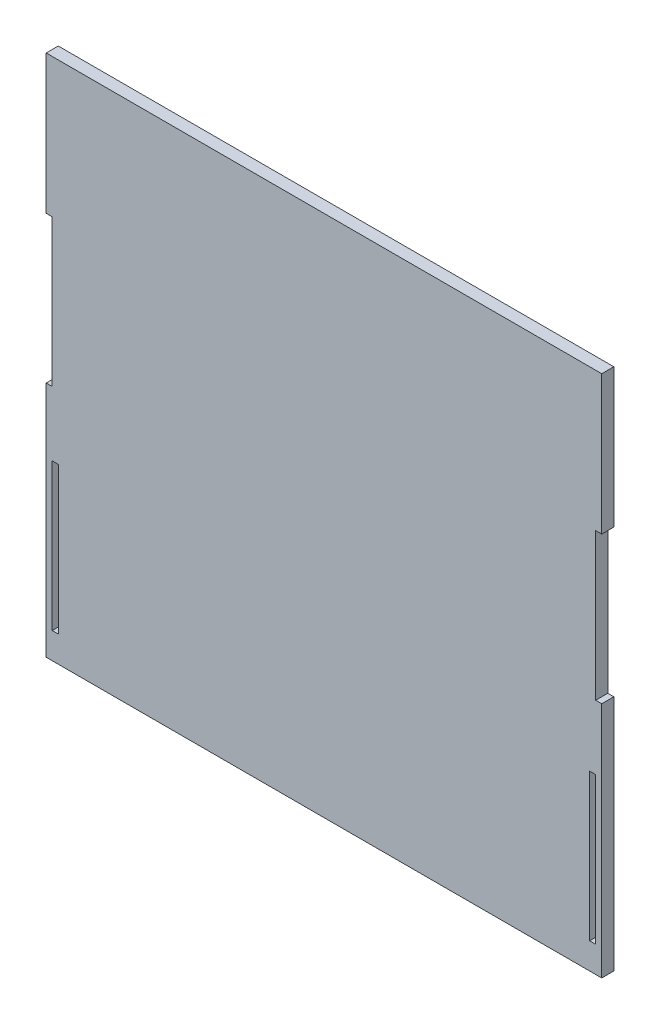
ISO-10303-21;
HEADER;
FILE_DESCRIPTION(('STEP AP214'),'2;1');
FILE_NAME('part.step','',(''),(''),'','','');
FILE_SCHEMA(('AUTOMOTIVE_DESIGN { 1 0 10303 214 1 1 1 1 }'));
ENDSEC;
DATA;
#1=APPLICATION_CONTEXT('core data for automotive mechanical design processes');
#2=APPLICATION_PROTOCOL_DEFINITION('international standard','automotive_design',2000,#1);
#3=PRODUCT_CONTEXT('',#1,'mechanical');
#4=PRODUCT('Part','Part','',(#3));
#5=PRODUCT_RELATED_PRODUCT_CATEGORY('part','',(#4));
#6=PRODUCT_DEFINITION_FORMATION('','',#4);
#7=PRODUCT_DEFINITION_CONTEXT('part definition',#1,'design');
#8=PRODUCT_DEFINITION('design','',#6,#7);
#9=PRODUCT_DEFINITION_SHAPE('','',#8);
#10=(LENGTH_UNIT() NAMED_UNIT(*) SI_UNIT(.MILLI.,.METRE.));
#11=(NAMED_UNIT(*) PLANE_ANGLE_UNIT() SI_UNIT($,.RADIAN.));
#12=(NAMED_UNIT(*) SI_UNIT($,.STERADIAN.) SOLID_ANGLE_UNIT());
#13=UNCERTAINTY_MEASURE_WITH_UNIT(LENGTH_MEASURE(1.E-05),#10,'distance_accuracy_value','');
#14=(GEOMETRIC_REPRESENTATION_CONTEXT(3) GLOBAL_UNCERTAINTY_ASSIGNED_CONTEXT((#13)) GLOBAL_UNIT_ASSIGNED_CONTEXT((#10,
#11,#12)) REPRESENTATION_CONTEXT('',''));
#15=CARTESIAN_POINT('',(0.,0.,0.));
#16=DIRECTION('',(0.,0.,1.));
#17=DIRECTION('',(1.,0.,0.));
#18=AXIS2_PLACEMENT_3D('',#15,#16,#17);
#19=CARTESIAN_POINT('',(0.,95.5,3.));
#20=DIRECTION('',(0.,1.,0.));
#21=DIRECTION('',(0.,0.,1.));
#22=AXIS2_PLACEMENT_3D('',#19,#20,#21);
#23=PLANE('',#22);
#24=DIRECTION('',(1.,0.,0.));
#25=VECTOR('',#24,1.);
#26=CARTESIAN_POINT('',(0.,95.5,0.));
#27=LINE('',#26,#25);
#28=CARTESIAN_POINT('',(0.,95.5,0.));
#29=VERTEX_POINT('',#28);
#30=CARTESIAN_POINT('',(1.5,95.5,0.));
#31=VERTEX_POINT('',#30);
#32=EDGE_CURVE('E254',#29,#31,#27,.T.);
#33=ORIENTED_EDGE('',*,*,#32,.T.);
#34=DIRECTION('',(0.,0.,-1.));
#35=VECTOR('',#34,1.);
#36=CARTESIAN_POINT('',(1.5,95.5,3.));
#37=LINE('',#36,#35);
#38=CARTESIAN_POINT('',(1.5,95.5,3.));
#39=VERTEX_POINT('',#38);
#40=EDGE_CURVE('E11',#39,#31,#37,.T.);
#41=ORIENTED_EDGE('',*,*,#40,.F.);
#42=DIRECTION('',(1.,0.,0.));
#43=VECTOR('',#42,1.);
#44=CARTESIAN_POINT('',(0.,95.5,3.));
#45=LINE('',#44,#43);
#46=CARTESIAN_POINT('',(0.,95.5,3.));
#47=VERTEX_POINT('',#46);
#48=EDGE_CURVE('E383',#47,#39,#45,.T.);
#49=ORIENTED_EDGE('',*,*,#48,.F.);
#50=DIRECTION('',(0.,0.,-1.));
#51=VECTOR('',#50,1.);
#52=CARTESIAN_POINT('',(0.,95.5,3.));
#53=LINE('',#52,#51);
#54=EDGE_CURVE('E61',#47,#29,#53,.T.);
#55=ORIENTED_EDGE('',*,*,#54,.T.);
#56=EDGE_LOOP('',(#33,#41,#49,#55));
#57=FACE_BOUND('',#56,.T.);
#58=ADVANCED_FACE('F41',(#57),#23,.F.);
#59=CARTESIAN_POINT('',(1.50000000000001,0.,3.));
#60=DIRECTION('',(1.,0.,0.));
#61=DIRECTION('',(0.,1.,0.));
#62=AXIS2_PLACEMENT_3D('',#59,#60,#61);
#63=PLANE('',#62);
#64=DIRECTION('',(0.,-1.,0.));
#65=VECTOR('',#64,1.);
#66=CARTESIAN_POINT('',(1.50000000000001,0.,0.));
#67=LINE('',#66,#65);
#68=CARTESIAN_POINT('',(1.50000000000001,59.,0.));
#69=VERTEX_POINT('',#68);
#70=EDGE_CURVE('E257',#31,#69,#67,.T.);
#71=ORIENTED_EDGE('',*,*,#70,.T.);
#72=DIRECTION('',(0.,0.,-1.));
#73=VECTOR('',#72,1.);
#74=CARTESIAN_POINT('',(1.50000000000001,59.,3.));
#75=LINE('',#74,#73);
#76=CARTESIAN_POINT('',(1.50000000000001,59.,3.));
#77=VERTEX_POINT('',#76);
#78=EDGE_CURVE('E52',#77,#69,#75,.T.);
#79=ORIENTED_EDGE('',*,*,#78,.F.);
#80=DIRECTION('',(0.,-1.,0.));
#81=VECTOR('',#80,1.);
#82=CARTESIAN_POINT('',(1.50000000000001,0.,3.));
#83=LINE('',#82,#81);
#84=EDGE_CURVE('E386',#39,#77,#83,.T.);
#85=ORIENTED_EDGE('',*,*,#84,.F.);
#86=ORIENTED_EDGE('',*,*,#40,.T.);
#87=EDGE_LOOP('',(#71,#79,#85,#86));
#88=FACE_BOUND('',#87,.T.);
#89=ADVANCED_FACE('F444',(#88),#63,.F.);
#90=CARTESIAN_POINT('',(0.,59.,3.));
#91=DIRECTION('',(0.,1.,0.));
#92=DIRECTION('',(0.,0.,1.));
#93=AXIS2_PLACEMENT_3D('',#90,#91,#92);
#94=PLANE('',#93);
#95=DIRECTION('',(1.,0.,0.));
#96=VECTOR('',#95,1.);
#97=CARTESIAN_POINT('',(0.,59.,0.));
#98=LINE('',#97,#96);
#99=CARTESIAN_POINT('',(0.,59.,0.));
#100=VERTEX_POINT('',#99);
#101=EDGE_CURVE('E261',#100,#69,#98,.T.);
#102=ORIENTED_EDGE('',*,*,#101,.F.);
#103=DIRECTION('',(0.,0.,-1.));
#104=VECTOR('',#103,1.);
#105=CARTESIAN_POINT('',(0.,59.,3.));
#106=LINE('',#105,#104);
#107=CARTESIAN_POINT('',(0.,59.,3.));
#108=VERTEX_POINT('',#107);
#109=EDGE_CURVE('E315',#108,#100,#106,.T.);
#110=ORIENTED_EDGE('',*,*,#109,.F.);
#111=DIRECTION('',(1.,0.,0.));
#112=VECTOR('',#111,1.);
#113=CARTESIAN_POINT('',(0.,59.,3.));
#114=LINE('',#113,#112);
#115=EDGE_CURVE('E389',#108,#77,#114,.T.);
#116=ORIENTED_EDGE('',*,*,#115,.T.);
#117=ORIENTED_EDGE('',*,*,#78,.T.);
#118=EDGE_LOOP('',(#102,#110,#116,#117));
#119=FACE_BOUND('',#118,.T.);
#120=ADVANCED_FACE('F449',(#119),#94,.T.);
#121=CARTESIAN_POINT('',(0.,0.,3.));
#122=DIRECTION('',(-1.,0.,0.));
#123=DIRECTION('',(0.,0.,1.));
#124=AXIS2_PLACEMENT_3D('',#121,#122,#123);
#125=PLANE('',#124);
#126=DIRECTION('',(0.,1.,0.));
#127=VECTOR('',#126,1.);
#128=CARTESIAN_POINT('',(0.,0.,0.));
#129=LINE('',#128,#127);
#130=CARTESIAN_POINT('',(0.,0.,0.));
#131=VERTEX_POINT('',#130);
#132=EDGE_CURVE('E265',#131,#100,#129,.T.);
#133=ORIENTED_EDGE('',*,*,#132,.F.);
#134=DIRECTION('',(0.,0.,-1.));
#135=VECTOR('',#134,1.);
#136=CARTESIAN_POINT('',(0.,0.,3.));
#137=LINE('',#136,#135);
#138=CARTESIAN_POINT('',(0.,0.,3.));
#139=VERTEX_POINT('',#138);
#140=EDGE_CURVE('E312',#139,#131,#137,.T.);
#141=ORIENTED_EDGE('',*,*,#140,.F.);
#142=DIRECTION('',(0.,1.,0.));
#143=VECTOR('',#142,1.);
#144=CARTESIAN_POINT('',(0.,0.,3.));
#145=LINE('',#144,#143);
#146=EDGE_CURVE('E219',#139,#108,#145,.T.);
#147=ORIENTED_EDGE('',*,*,#146,.T.);
#148=ORIENTED_EDGE('',*,*,#109,.T.);
#149=EDGE_LOOP('',(#133,#141,#147,#148));
#150=FACE_BOUND('',#149,.T.);
#151=ADVANCED_FACE('F530',(#150),#125,.T.);
#152=CARTESIAN_POINT('',(0.,0.,3.));
#153=DIRECTION('',(0.,1.,0.));
#154=DIRECTION('',(0.,0.,1.));
#155=AXIS2_PLACEMENT_3D('',#152,#153,#154);
#156=PLANE('',#155);
#157=DIRECTION('',(1.,0.,0.));
#158=VECTOR('',#157,1.);
#159=CARTESIAN_POINT('',(0.,0.,0.));
#160=LINE('',#159,#158);
#161=CARTESIAN_POINT('',(138.,0.,0.));
#162=VERTEX_POINT('',#161);
#163=EDGE_CURVE('E269',#131,#162,#160,.T.);
#164=ORIENTED_EDGE('',*,*,#163,.T.);
#165=DIRECTION('',(0.,0.,-1.));
#166=VECTOR('',#165,1.);
#167=CARTESIAN_POINT('',(138.,0.,3.));
#168=LINE('',#167,#166);
#169=CARTESIAN_POINT('',(138.,0.,3.));
#170=VERTEX_POINT('',#169);
#171=EDGE_CURVE('E308',#170,#162,#168,.T.);
#172=ORIENTED_EDGE('',*,*,#171,.F.);
#173=DIRECTION('',(1.,0.,0.));
#174=VECTOR('',#173,1.);
#175=CARTESIAN_POINT('',(0.,0.,3.));
#176=LINE('',#175,#174);
#177=EDGE_CURVE('E395',#139,#170,#176,.T.);
#178=ORIENTED_EDGE('',*,*,#177,.F.);
#179=ORIENTED_EDGE('',*,*,#140,.T.);
#180=EDGE_LOOP('',(#164,#172,#178,#179));
#181=FACE_BOUND('',#180,.T.);
#182=ADVANCED_FACE('F523',(#181),#156,.F.);
#183=CARTESIAN_POINT('',(138.,0.,3.));
#184=DIRECTION('',(-1.,0.,0.));
#185=DIRECTION('',(0.,0.,1.));
#186=AXIS2_PLACEMENT_3D('',#183,#184,#185);
#187=PLANE('',#186);
#188=DIRECTION('',(0.,1.,0.));
#189=VECTOR('',#188,1.);
#190=CARTESIAN_POINT('',(138.,0.,0.));
#191=LINE('',#190,#189);
#192=CARTESIAN_POINT('',(138.,59.,0.));
#193=VERTEX_POINT('',#192);
#194=EDGE_CURVE('E273',#162,#193,#191,.T.);
#195=ORIENTED_EDGE('',*,*,#194,.T.);
#196=DIRECTION('',(0.,0.,-1.));
#197=VECTOR('',#196,1.);
#198=CARTESIAN_POINT('',(138.,59.,3.));
#199=LINE('',#198,#197);
#200=CARTESIAN_POINT('',(138.,59.,3.));
#201=VERTEX_POINT('',#200);
#202=EDGE_CURVE('E304',#201,#193,#199,.T.);
#203=ORIENTED_EDGE('',*,*,#202,.F.);
#204=DIRECTION('',(0.,1.,0.));
#205=VECTOR('',#204,1.);
#206=CARTESIAN_POINT('',(138.,0.,3.));
#207=LINE('',#206,#205);
#208=EDGE_CURVE('E201',#170,#201,#207,.T.);
#209=ORIENTED_EDGE('',*,*,#208,.F.);
#210=ORIENTED_EDGE('',*,*,#171,.T.);
#211=EDGE_LOOP('',(#195,#203,#209,#210));
#212=FACE_BOUND('',#211,.T.);
#213=ADVANCED_FACE('F496',(#212),#187,.F.);
#214=CARTESIAN_POINT('',(2.7292982688702E-13,59.0000000000006,3.));
#215=DIRECTION('',(0.,-1.,0.));
#216=DIRECTION('',(1.,0.,0.));
#217=AXIS2_PLACEMENT_3D('',#214,#215,#216);
#218=PLANE('',#217);
#219=DIRECTION('',(-1.,0.,0.));
#220=VECTOR('',#219,1.);
#221=CARTESIAN_POINT('',(2.7292982688702E-13,59.0000000000006,0.));
#222=LINE('',#221,#220);
#223=CARTESIAN_POINT('',(136.5,59.,0.));
#224=VERTEX_POINT('',#223);
#225=EDGE_CURVE('E276',#193,#224,#222,.T.);
#226=ORIENTED_EDGE('',*,*,#225,.T.);
#227=DIRECTION('',(0.,0.,-1.));
#228=VECTOR('',#227,1.);
#229=CARTESIAN_POINT('',(136.5,59.,3.));
#230=LINE('',#229,#228);
#231=CARTESIAN_POINT('',(136.5,59.,3.));
#232=VERTEX_POINT('',#231);
#233=EDGE_CURVE('E301',#232,#224,#230,.T.);
#234=ORIENTED_EDGE('',*,*,#233,.F.);
#235=DIRECTION('',(-1.,0.,0.));
#236=VECTOR('',#235,1.);
#237=CARTESIAN_POINT('',(2.7292982688702E-13,59.0000000000006,3.));
#238=LINE('',#237,#236);
#239=EDGE_CURVE('E399',#201,#232,#238,.T.);
#240=ORIENTED_EDGE('',*,*,#239,.F.);
#241=ORIENTED_EDGE('',*,*,#202,.T.);
#242=EDGE_LOOP('',(#226,#234,#240,#241));
#243=FACE_BOUND('',#242,.T.);
#244=ADVANCED_FACE('F509',(#243),#218,.F.);
#245=CARTESIAN_POINT('',(136.5,0.,3.));
#246=DIRECTION('',(1.,0.,0.));
#247=DIRECTION('',(0.,0.,-1.));
#248=AXIS2_PLACEMENT_3D('',#245,#246,#247);
#249=PLANE('',#248);
#250=DIRECTION('',(0.,-1.,0.));
#251=VECTOR('',#250,1.);
#252=CARTESIAN_POINT('',(136.5,0.,0.));
#253=LINE('',#252,#251);
#254=CARTESIAN_POINT('',(136.5,95.5,0.));
#255=VERTEX_POINT('',#254);
#256=EDGE_CURVE('E280',#255,#224,#253,.T.);
#257=ORIENTED_EDGE('',*,*,#256,.F.);
#258=DIRECTION('',(0.,0.,-1.));
#259=VECTOR('',#258,1.);
#260=CARTESIAN_POINT('',(136.5,95.5,3.));
#261=LINE('',#260,#259);
#262=CARTESIAN_POINT('',(136.5,95.5,3.));
#263=VERTEX_POINT('',#262);
#264=EDGE_CURVE('E298',#263,#255,#261,.T.);
#265=ORIENTED_EDGE('',*,*,#264,.F.);
#266=DIRECTION('',(0.,-1.,0.));
#267=VECTOR('',#266,1.);
#268=CARTESIAN_POINT('',(136.5,0.,3.));
#269=LINE('',#268,#267);
#270=EDGE_CURVE('E401',#263,#232,#269,.T.);
#271=ORIENTED_EDGE('',*,*,#270,.T.);
#272=ORIENTED_EDGE('',*,*,#233,.T.);
#273=EDGE_LOOP('',(#257,#265,#271,#272));
#274=FACE_BOUND('',#273,.T.);
#275=ADVANCED_FACE('F502',(#274),#249,.T.);
#276=CARTESIAN_POINT('',(8.83552490430865E-13,95.5000000000013,3.));
#277=DIRECTION('',(0.,-1.,0.));
#278=DIRECTION('',(1.,0.,0.));
#279=AXIS2_PLACEMENT_3D('',#276,#277,#278);
#280=PLANE('',#279);
#281=DIRECTION('',(-1.,0.,0.));
#282=VECTOR('',#281,1.);
#283=CARTESIAN_POINT('',(8.83552490430865E-13,95.5000000000013,0.));
#284=LINE('',#283,#282);
#285=CARTESIAN_POINT('',(138.,95.5,0.));
#286=VERTEX_POINT('',#285);
#287=EDGE_CURVE('E284',#286,#255,#284,.T.);
#288=ORIENTED_EDGE('',*,*,#287,.F.);
#289=DIRECTION('',(0.,0.,-1.));
#290=VECTOR('',#289,1.);
#291=CARTESIAN_POINT('',(138.,95.5,3.));
#292=LINE('',#291,#290);
#293=CARTESIAN_POINT('',(138.,95.5,3.));
#294=VERTEX_POINT('',#293);
#295=EDGE_CURVE('E210',#294,#286,#292,.T.);
#296=ORIENTED_EDGE('',*,*,#295,.F.);
#297=DIRECTION('',(-1.,0.,0.));
#298=VECTOR('',#297,1.);
#299=CARTESIAN_POINT('',(8.83552490430865E-13,95.5000000000013,3.));
#300=LINE('',#299,#298);
#301=EDGE_CURVE('E197',#294,#263,#300,.T.);
#302=ORIENTED_EDGE('',*,*,#301,.T.);
#303=ORIENTED_EDGE('',*,*,#264,.T.);
#304=EDGE_LOOP('',(#288,#296,#302,#303));
#305=FACE_BOUND('',#304,.T.);
#306=ADVANCED_FACE('F408',(#305),#280,.T.);
#307=CARTESIAN_POINT('',(138.,130.,0.));
#308=VERTEX_POINT('',#307);
#309=EDGE_CURVE('E206',#286,#308,#191,.T.);
#310=ORIENTED_EDGE('',*,*,#309,.T.);
#311=DIRECTION('',(0.,0.,-1.));
#312=VECTOR('',#311,1.);
#313=CARTESIAN_POINT('',(138.,130.,3.));
#314=LINE('',#313,#312);
#315=CARTESIAN_POINT('',(138.,130.,3.));
#316=VERTEX_POINT('',#315);
#317=EDGE_CURVE('E203',#316,#308,#314,.T.);
#318=ORIENTED_EDGE('',*,*,#317,.F.);
#319=EDGE_CURVE('E188',#294,#316,#207,.T.);
#320=ORIENTED_EDGE('',*,*,#319,.F.);
#321=ORIENTED_EDGE('',*,*,#295,.T.);
#322=EDGE_LOOP('',(#310,#318,#320,#321));
#323=FACE_BOUND('',#322,.T.);
#324=ADVANCED_FACE('F204',(#323),#187,.F.);
#325=CARTESIAN_POINT('',(0.,130.,3.));
#326=DIRECTION('',(0.,1.,0.));
#327=DIRECTION('',(0.,0.,1.));
#328=AXIS2_PLACEMENT_3D('',#325,#326,#327);
#329=PLANE('',#328);
#330=DIRECTION('',(1.,0.,0.));
#331=VECTOR('',#330,1.);
#332=CARTESIAN_POINT('',(0.,130.,0.));
#333=LINE('',#332,#331);
#334=CARTESIAN_POINT('',(0.,130.,0.));
#335=VERTEX_POINT('',#334);
#336=EDGE_CURVE('E288',#335,#308,#333,.T.);
#337=ORIENTED_EDGE('',*,*,#336,.F.);
#338=DIRECTION('',(0.,0.,-1.));
#339=VECTOR('',#338,1.);
#340=CARTESIAN_POINT('',(0.,130.,3.));
#341=LINE('',#340,#339);
#342=CARTESIAN_POINT('',(0.,130.,3.));
#343=VERTEX_POINT('',#342);
#344=EDGE_CURVE('E123',#343,#335,#341,.T.);
#345=ORIENTED_EDGE('',*,*,#344,.F.);
#346=DIRECTION('',(1.,0.,0.));
#347=VECTOR('',#346,1.);
#348=CARTESIAN_POINT('',(0.,130.,3.));
#349=LINE('',#348,#347);
#350=EDGE_CURVE('E194',#343,#316,#349,.T.);
#351=ORIENTED_EDGE('',*,*,#350,.T.);
#352=ORIENTED_EDGE('',*,*,#317,.T.);
#353=EDGE_LOOP('',(#337,#345,#351,#352));
#354=FACE_BOUND('',#353,.T.);
#355=ADVANCED_FACE('F212',(#354),#329,.T.);
#356=CARTESIAN_POINT('',(135.,0.,3.));
#357=DIRECTION('',(1.,0.,0.));
#358=DIRECTION('',(0.,0.,-1.));
#359=AXIS2_PLACEMENT_3D('',#356,#357,#358);
#360=PLANE('',#359);
#361=DIRECTION('',(0.,-1.,0.));
#362=VECTOR('',#361,1.);
#363=CARTESIAN_POINT('',(135.,0.,0.));
#364=LINE('',#363,#362);
#365=CARTESIAN_POINT('',(135.,43.,0.));
#366=VERTEX_POINT('',#365);
#367=CARTESIAN_POINT('',(135.,6.5,0.));
#368=VERTEX_POINT('',#367);
#369=EDGE_CURVE('E238',#366,#368,#364,.T.);
#370=ORIENTED_EDGE('',*,*,#369,.F.);
#371=DIRECTION('',(0.,0.,-1.));
#372=VECTOR('',#371,1.);
#373=CARTESIAN_POINT('',(135.,43.,3.));
#374=LINE('',#373,#372);
#375=CARTESIAN_POINT('',(135.,43.,3.));
#376=VERTEX_POINT('',#375);
#377=EDGE_CURVE('E293',#376,#366,#374,.T.);
#378=ORIENTED_EDGE('',*,*,#377,.F.);
#379=DIRECTION('',(0.,-1.,0.));
#380=VECTOR('',#379,1.);
#381=CARTESIAN_POINT('',(135.,0.,3.));
#382=LINE('',#381,#380);
#383=CARTESIAN_POINT('',(135.,6.5,3.));
#384=VERTEX_POINT('',#383);
#385=EDGE_CURVE('E362',#376,#384,#382,.T.);
#386=ORIENTED_EDGE('',*,*,#385,.T.);
#387=DIRECTION('',(0.,0.,-1.));
#388=VECTOR('',#387,1.);
#389=CARTESIAN_POINT('',(135.,6.5,3.));
#390=LINE('',#389,#388);
#391=EDGE_CURVE('E320',#384,#368,#390,.T.);
#392=ORIENTED_EDGE('',*,*,#391,.T.);
#393=EDGE_LOOP('',(#370,#378,#386,#392));
#394=FACE_BOUND('',#393,.T.);
#395=ADVANCED_FACE('F437',(#394),#360,.T.);
#396=CARTESIAN_POINT('',(0.,43.,3.));
#397=DIRECTION('',(0.,-1.,0.));
#398=DIRECTION('',(0.,0.,-1.));
#399=AXIS2_PLACEMENT_3D('',#396,#397,#398);
#400=PLANE('',#399);
#401=DIRECTION('',(-1.,0.,0.));
#402=VECTOR('',#401,1.);
#403=CARTESIAN_POINT('',(0.,43.,0.));
#404=LINE('',#403,#402);
#405=CARTESIAN_POINT('',(136.5,43.,0.));
#406=VERTEX_POINT('',#405);
#407=EDGE_CURVE('E242',#406,#366,#404,.T.);
#408=ORIENTED_EDGE('',*,*,#407,.F.);
#409=DIRECTION('',(0.,0.,-1.));
#410=VECTOR('',#409,1.);
#411=CARTESIAN_POINT('',(136.5,43.,3.));
#412=LINE('',#411,#410);
#413=CARTESIAN_POINT('',(136.5,43.,3.));
#414=VERTEX_POINT('',#413);
#415=EDGE_CURVE('E327',#414,#406,#412,.T.);
#416=ORIENTED_EDGE('',*,*,#415,.F.);
#417=DIRECTION('',(-1.,0.,0.));
#418=VECTOR('',#417,1.);
#419=CARTESIAN_POINT('',(0.,43.,3.));
#420=LINE('',#419,#418);
#421=EDGE_CURVE('E368',#414,#376,#420,.T.);
#422=ORIENTED_EDGE('',*,*,#421,.T.);
#423=ORIENTED_EDGE('',*,*,#377,.T.);
#424=EDGE_LOOP('',(#408,#416,#422,#423));
#425=FACE_BOUND('',#424,.T.);
#426=ADVANCED_FACE('F428',(#425),#400,.T.);
#427=CARTESIAN_POINT('',(136.5,0.,3.));
#428=DIRECTION('',(1.,0.,0.));
#429=DIRECTION('',(0.,0.,-1.));
#430=AXIS2_PLACEMENT_3D('',#427,#428,#429);
#431=PLANE('',#430);
#432=DIRECTION('',(0.,-1.,0.));
#433=VECTOR('',#432,1.);
#434=CARTESIAN_POINT('',(136.5,0.,0.));
#435=LINE('',#434,#433);
#436=CARTESIAN_POINT('',(136.5,6.50000000000001,0.));
#437=VERTEX_POINT('',#436);
#438=EDGE_CURVE('E246',#406,#437,#435,.T.);
#439=ORIENTED_EDGE('',*,*,#438,.T.);
#440=DIRECTION('',(0.,0.,-1.));
#441=VECTOR('',#440,1.);
#442=CARTESIAN_POINT('',(136.5,6.50000000000001,3.));
#443=LINE('',#442,#441);
#444=CARTESIAN_POINT('',(136.5,6.50000000000001,3.));
#445=VERTEX_POINT('',#444);
#446=EDGE_CURVE('E323',#445,#437,#443,.T.);
#447=ORIENTED_EDGE('',*,*,#446,.F.);
#448=DIRECTION('',(0.,-1.,0.));
#449=VECTOR('',#448,1.);
#450=CARTESIAN_POINT('',(136.5,0.,3.));
#451=LINE('',#450,#449);
#452=EDGE_CURVE('E376',#414,#445,#451,.T.);
#453=ORIENTED_EDGE('',*,*,#452,.F.);
#454=ORIENTED_EDGE('',*,*,#415,.T.);
#455=EDGE_LOOP('',(#439,#447,#453,#454));
#456=FACE_BOUND('',#455,.T.);
#457=ADVANCED_FACE('F434',(#456),#431,.F.);
#458=CARTESIAN_POINT('',(1.50000000000001,0.,3.));
#459=DIRECTION('',(1.,0.,0.));
#460=DIRECTION('',(0.,1.,0.));
#461=AXIS2_PLACEMENT_3D('',#458,#459,#460);
#462=PLANE('',#461);
#463=DIRECTION('',(0.,-1.,0.));
#464=VECTOR('',#463,1.);
#465=CARTESIAN_POINT('',(1.50000000000001,0.,0.));
#466=LINE('',#465,#464);
#467=CARTESIAN_POINT('',(1.5,43.,0.));
#468=VERTEX_POINT('',#467);
#469=CARTESIAN_POINT('',(1.50000000000001,6.5,0.));
#470=VERTEX_POINT('',#469);
#471=EDGE_CURVE('E223',#468,#470,#466,.T.);
#472=ORIENTED_EDGE('',*,*,#471,.F.);
#473=DIRECTION('',(0.,0.,-1.));
#474=VECTOR('',#473,1.);
#475=CARTESIAN_POINT('',(1.5,43.,3.));
#476=LINE('',#475,#474);
#477=CARTESIAN_POINT('',(1.5,43.,3.));
#478=VERTEX_POINT('',#477);
#479=EDGE_CURVE('E45',#478,#468,#476,.T.);
#480=ORIENTED_EDGE('',*,*,#479,.F.);
#481=DIRECTION('',(0.,-1.,0.));
#482=VECTOR('',#481,1.);
#483=CARTESIAN_POINT('',(1.50000000000001,0.,3.));
#484=LINE('',#483,#482);
#485=CARTESIAN_POINT('',(1.50000000000001,6.5,3.));
#486=VERTEX_POINT('',#485);
#487=EDGE_CURVE('E415',#478,#486,#484,.T.);
#488=ORIENTED_EDGE('',*,*,#487,.T.);
#489=DIRECTION('',(0.,0.,-1.));
#490=VECTOR('',#489,1.);
#491=CARTESIAN_POINT('',(1.50000000000001,6.5,3.));
#492=LINE('',#491,#490);
#493=EDGE_CURVE('E217',#486,#470,#492,.T.);
#494=ORIENTED_EDGE('',*,*,#493,.T.);
#495=EDGE_LOOP('',(#472,#480,#488,#494));
#496=FACE_BOUND('',#495,.T.);
#497=ADVANCED_FACE('F43',(#496),#462,.T.);
#498=CARTESIAN_POINT('',(0.,43.,3.));
#499=DIRECTION('',(0.,-1.,0.));
#500=DIRECTION('',(0.,0.,-1.));
#501=AXIS2_PLACEMENT_3D('',#498,#499,#500);
#502=PLANE('',#501);
#503=DIRECTION('',(-1.,0.,0.));
#504=VECTOR('',#503,1.);
#505=CARTESIAN_POINT('',(0.,43.,0.));
#506=LINE('',#505,#504);
#507=CARTESIAN_POINT('',(3.,43.,0.));
#508=VERTEX_POINT('',#507);
#509=EDGE_CURVE('E227',#508,#468,#506,.T.);
#510=ORIENTED_EDGE('',*,*,#509,.F.);
#511=DIRECTION('',(0.,0.,-1.));
#512=VECTOR('',#511,1.);
#513=CARTESIAN_POINT('',(3.,43.,3.));
#514=LINE('',#513,#512);
#515=CARTESIAN_POINT('',(3.,43.,3.));
#516=VERTEX_POINT('',#515);
#517=EDGE_CURVE('E337',#516,#508,#514,.T.);
#518=ORIENTED_EDGE('',*,*,#517,.F.);
#519=DIRECTION('',(-1.,0.,0.));
#520=VECTOR('',#519,1.);
#521=CARTESIAN_POINT('',(0.,43.,3.));
#522=LINE('',#521,#520);
#523=EDGE_CURVE('E348',#516,#478,#522,.T.);
#524=ORIENTED_EDGE('',*,*,#523,.T.);
#525=ORIENTED_EDGE('',*,*,#479,.T.);
#526=EDGE_LOOP('',(#510,#518,#524,#525));
#527=FACE_BOUND('',#526,.T.);
#528=ADVANCED_FACE('F346',(#527),#502,.T.);
#529=CARTESIAN_POINT('',(3.00000000000001,0.,3.));
#530=DIRECTION('',(1.,0.,0.));
#531=DIRECTION('',(0.,1.,0.));
#532=AXIS2_PLACEMENT_3D('',#529,#530,#531);
#533=PLANE('',#532);
#534=DIRECTION('',(0.,-1.,0.));
#535=VECTOR('',#534,1.);
#536=CARTESIAN_POINT('',(3.00000000000001,0.,0.));
#537=LINE('',#536,#535);
#538=CARTESIAN_POINT('',(3.00000000000001,6.5,0.));
#539=VERTEX_POINT('',#538);
#540=EDGE_CURVE('E231',#508,#539,#537,.T.);
#541=ORIENTED_EDGE('',*,*,#540,.T.);
#542=DIRECTION('',(0.,0.,-1.));
#543=VECTOR('',#542,1.);
#544=CARTESIAN_POINT('',(3.00000000000001,6.5,3.));
#545=LINE('',#544,#543);
#546=CARTESIAN_POINT('',(3.00000000000001,6.5,3.));
#547=VERTEX_POINT('',#546);
#548=EDGE_CURVE('E334',#547,#539,#545,.T.);
#549=ORIENTED_EDGE('',*,*,#548,.F.);
#550=DIRECTION('',(0.,-1.,0.));
#551=VECTOR('',#550,1.);
#552=CARTESIAN_POINT('',(3.00000000000001,0.,3.));
#553=LINE('',#552,#551);
#554=EDGE_CURVE('E363',#516,#547,#553,.T.);
#555=ORIENTED_EDGE('',*,*,#554,.F.);
#556=ORIENTED_EDGE('',*,*,#517,.T.);
#557=EDGE_LOOP('',(#541,#549,#555,#556));
#558=FACE_BOUND('',#557,.T.);
#559=ADVANCED_FACE('F355',(#558),#533,.F.);
#560=CARTESIAN_POINT('',(0.,6.49999999999945,3.));
#561=DIRECTION('',(0.,-1.,0.));
#562=DIRECTION('',(1.,0.,0.));
#563=AXIS2_PLACEMENT_3D('',#560,#561,#562);
#564=PLANE('',#563);
#565=DIRECTION('',(-1.,0.,0.));
#566=VECTOR('',#565,1.);
#567=CARTESIAN_POINT('',(0.,6.49999999999945,0.));
#568=LINE('',#567,#566);
#569=EDGE_CURVE('E250',#437,#368,#568,.T.);
#570=ORIENTED_EDGE('',*,*,#569,.T.);
#571=ORIENTED_EDGE('',*,*,#391,.F.);
#572=DIRECTION('',(-1.,0.,0.));
#573=VECTOR('',#572,1.);
#574=CARTESIAN_POINT('',(0.,6.49999999999945,3.));
#575=LINE('',#574,#573);
#576=EDGE_CURVE('E380',#445,#384,#575,.T.);
#577=ORIENTED_EDGE('',*,*,#576,.F.);
#578=ORIENTED_EDGE('',*,*,#446,.T.);
#579=EDGE_LOOP('',(#570,#571,#577,#578));
#580=FACE_BOUND('',#579,.T.);
#581=ADVANCED_FACE('F436',(#580),#564,.F.);
#582=CARTESIAN_POINT('',(0.,6.5,3.));
#583=DIRECTION('',(0.,-1.,0.));
#584=DIRECTION('',(0.,0.,-1.));
#585=AXIS2_PLACEMENT_3D('',#582,#583,#584);
#586=PLANE('',#585);
#587=DIRECTION('',(-1.,0.,0.));
#588=VECTOR('',#587,1.);
#589=CARTESIAN_POINT('',(0.,6.5,0.));
#590=LINE('',#589,#588);
#591=EDGE_CURVE('E234',#539,#470,#590,.T.);
#592=ORIENTED_EDGE('',*,*,#591,.T.);
#593=ORIENTED_EDGE('',*,*,#493,.F.);
#594=DIRECTION('',(-1.,0.,0.));
#595=VECTOR('',#594,1.);
#596=CARTESIAN_POINT('',(0.,6.5,3.));
#597=LINE('',#596,#595);
#598=EDGE_CURVE('E359',#547,#486,#597,.T.);
#599=ORIENTED_EDGE('',*,*,#598,.F.);
#600=ORIENTED_EDGE('',*,*,#548,.T.);
#601=EDGE_LOOP('',(#592,#593,#599,#600));
#602=FACE_BOUND('',#601,.T.);
#603=ADVANCED_FACE('F358',(#602),#586,.F.);
#604=EDGE_CURVE('E270',#29,#335,#129,.T.);
#605=ORIENTED_EDGE('',*,*,#604,.F.);
#606=ORIENTED_EDGE('',*,*,#54,.F.);
#607=EDGE_CURVE('E214',#47,#343,#145,.T.);
#608=ORIENTED_EDGE('',*,*,#607,.T.);
#609=ORIENTED_EDGE('',*,*,#344,.T.);
#610=EDGE_LOOP('',(#605,#606,#608,#609));
#611=FACE_BOUND('',#610,.T.);
#612=ADVANCED_FACE('F420',(#611),#125,.T.);
#613=CARTESIAN_POINT('',(0.,0.,3.));
#614=DIRECTION('',(0.,0.,1.));
#615=DIRECTION('',(1.,0.,0.));
#616=AXIS2_PLACEMENT_3D('',#613,#614,#615);
#617=PLANE('',#616);
#618=ORIENTED_EDGE('',*,*,#487,.F.);
#619=ORIENTED_EDGE('',*,*,#523,.F.);
#620=ORIENTED_EDGE('',*,*,#554,.T.);
#621=ORIENTED_EDGE('',*,*,#598,.T.);
#622=EDGE_LOOP('',(#618,#619,#620,#621));
#623=FACE_BOUND('',#622,.T.);
#624=ORIENTED_EDGE('',*,*,#385,.F.);
#625=ORIENTED_EDGE('',*,*,#421,.F.);
#626=ORIENTED_EDGE('',*,*,#452,.T.);
#627=ORIENTED_EDGE('',*,*,#576,.T.);
#628=EDGE_LOOP('',(#624,#625,#626,#627));
#629=FACE_BOUND('',#628,.T.);
#630=ORIENTED_EDGE('',*,*,#48,.T.);
#631=ORIENTED_EDGE('',*,*,#84,.T.);
#632=ORIENTED_EDGE('',*,*,#115,.F.);
#633=ORIENTED_EDGE('',*,*,#146,.F.);
#634=ORIENTED_EDGE('',*,*,#177,.T.);
#635=ORIENTED_EDGE('',*,*,#208,.T.);
#636=ORIENTED_EDGE('',*,*,#239,.T.);
#637=ORIENTED_EDGE('',*,*,#270,.F.);
#638=ORIENTED_EDGE('',*,*,#301,.F.);
#639=ORIENTED_EDGE('',*,*,#319,.T.);
#640=ORIENTED_EDGE('',*,*,#350,.F.);
#641=ORIENTED_EDGE('',*,*,#607,.F.);
#642=EDGE_LOOP('',(#630,#631,#632,#633,#634,#635,#636,#637,#638,#639,#640,#641));
#643=FACE_BOUND('',#642,.T.);
#644=ADVANCED_FACE('F191',(#623,#629,#643),#617,.T.);
#645=CARTESIAN_POINT('',(0.,0.,0.));
#646=DIRECTION('',(0.,0.,1.));
#647=DIRECTION('',(1.,0.,0.));
#648=AXIS2_PLACEMENT_3D('',#645,#646,#647);
#649=PLANE('',#648);
#650=ORIENTED_EDGE('',*,*,#471,.T.);
#651=ORIENTED_EDGE('',*,*,#591,.F.);
#652=ORIENTED_EDGE('',*,*,#540,.F.);
#653=ORIENTED_EDGE('',*,*,#509,.T.);
#654=EDGE_LOOP('',(#650,#651,#652,#653));
#655=FACE_BOUND('',#654,.T.);
#656=ORIENTED_EDGE('',*,*,#369,.T.);
#657=ORIENTED_EDGE('',*,*,#569,.F.);
#658=ORIENTED_EDGE('',*,*,#438,.F.);
#659=ORIENTED_EDGE('',*,*,#407,.T.);
#660=EDGE_LOOP('',(#656,#657,#658,#659));
#661=FACE_BOUND('',#660,.T.);
#662=ORIENTED_EDGE('',*,*,#32,.F.);
#663=ORIENTED_EDGE('',*,*,#604,.T.);
#664=ORIENTED_EDGE('',*,*,#336,.T.);
#665=ORIENTED_EDGE('',*,*,#309,.F.);
#666=ORIENTED_EDGE('',*,*,#287,.T.);
#667=ORIENTED_EDGE('',*,*,#256,.T.);
#668=ORIENTED_EDGE('',*,*,#225,.F.);
#669=ORIENTED_EDGE('',*,*,#194,.F.);
#670=ORIENTED_EDGE('',*,*,#163,.F.);
#671=ORIENTED_EDGE('',*,*,#132,.T.);
#672=ORIENTED_EDGE('',*,*,#101,.T.);
#673=ORIENTED_EDGE('',*,*,#70,.F.);
#674=EDGE_LOOP('',(#662,#663,#664,#665,#666,#667,#668,#669,#670,#671,#672,#673));
#675=FACE_BOUND('',#674,.T.);
#676=ADVANCED_FACE('F352',(#655,#661,#675),#649,.F.);
#677=CLOSED_SHELL('',(#58,#89,#120,#151,#182,#213,#244,#275,#306,#324,#355,#395,#426,#457,#497,
#528,#559,#581,#603,#612,#644,#676));
#678=MANIFOLD_SOLID_BREP('B2',#677);
#679=ADVANCED_BREP_SHAPE_REPRESENTATION('',(#18,#678),#14);
#680=SHAPE_DEFINITION_REPRESENTATION(#9,#679);
ENDSEC;
END-ISO-10303-21;
